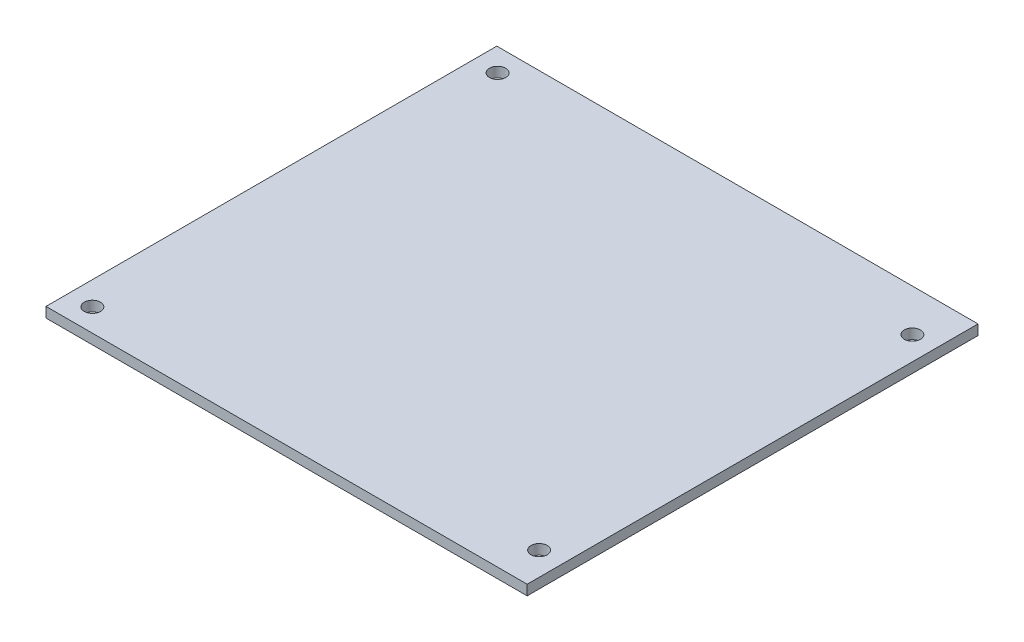
ISO-10303-21;
HEADER;
FILE_DESCRIPTION(('STEP AP214'),'2;1');
FILE_NAME('part.step','',(''),(''),'','','');
FILE_SCHEMA(('AUTOMOTIVE_DESIGN { 1 0 10303 214 1 1 1 1 }'));
ENDSEC;
DATA;
#1=APPLICATION_CONTEXT('core data for automotive mechanical design processes');
#2=APPLICATION_PROTOCOL_DEFINITION('international standard','automotive_design',2000,#1);
#3=PRODUCT_CONTEXT('',#1,'mechanical');
#4=PRODUCT('Part','Part','',(#3));
#5=PRODUCT_RELATED_PRODUCT_CATEGORY('part','',(#4));
#6=PRODUCT_DEFINITION_FORMATION('','',#4);
#7=PRODUCT_DEFINITION_CONTEXT('part definition',#1,'design');
#8=PRODUCT_DEFINITION('design','',#6,#7);
#9=PRODUCT_DEFINITION_SHAPE('','',#8);
#10=(LENGTH_UNIT() NAMED_UNIT(*) SI_UNIT(.MILLI.,.METRE.));
#11=(NAMED_UNIT(*) PLANE_ANGLE_UNIT() SI_UNIT($,.RADIAN.));
#12=(NAMED_UNIT(*) SI_UNIT($,.STERADIAN.) SOLID_ANGLE_UNIT());
#13=UNCERTAINTY_MEASURE_WITH_UNIT(LENGTH_MEASURE(1.E-05),#10,'distance_accuracy_value','');
#14=(GEOMETRIC_REPRESENTATION_CONTEXT(3) GLOBAL_UNCERTAINTY_ASSIGNED_CONTEXT((#13)) GLOBAL_UNIT_ASSIGNED_CONTEXT((#10,
#11,#12)) REPRESENTATION_CONTEXT('',''));
#15=CARTESIAN_POINT('',(0.,0.,0.));
#16=DIRECTION('',(0.,0.,1.));
#17=DIRECTION('',(1.,0.,0.));
#18=AXIS2_PLACEMENT_3D('',#15,#16,#17);
#19=CARTESIAN_POINT('',(0.,2.,0.));
#20=DIRECTION('',(0.,-1.,0.));
#21=DIRECTION('',(0.,0.,-1.));
#22=AXIS2_PLACEMENT_3D('',#19,#20,#21);
#23=PLANE('',#22);
#24=DIRECTION('',(0.,0.,-1.));
#25=VECTOR('',#24,1.);
#26=CARTESIAN_POINT('',(47.5,2.,44.505));
#27=LINE('',#26,#25);
#28=CARTESIAN_POINT('',(47.5,2.,44.505));
#29=VERTEX_POINT('',#28);
#30=CARTESIAN_POINT('',(47.5,2.,-44.505));
#31=VERTEX_POINT('',#30);
#32=EDGE_CURVE('E92',#29,#31,#27,.T.);
#33=ORIENTED_EDGE('',*,*,#32,.T.);
#34=DIRECTION('',(-1.,0.,0.));
#35=VECTOR('',#34,1.);
#36=CARTESIAN_POINT('',(-47.5,2.,-44.505));
#37=LINE('',#36,#35);
#38=CARTESIAN_POINT('',(-47.5,2.,-44.505));
#39=VERTEX_POINT('',#38);
#40=EDGE_CURVE('E87',#31,#39,#37,.T.);
#41=ORIENTED_EDGE('',*,*,#40,.T.);
#42=DIRECTION('',(0.,0.,1.));
#43=VECTOR('',#42,1.);
#44=CARTESIAN_POINT('',(-47.5,2.,44.505));
#45=LINE('',#44,#43);
#46=CARTESIAN_POINT('',(-47.5,2.,44.505));
#47=VERTEX_POINT('',#46);
#48=EDGE_CURVE('E90',#39,#47,#45,.T.);
#49=ORIENTED_EDGE('',*,*,#48,.T.);
#50=DIRECTION('',(1.,0.,0.));
#51=VECTOR('',#50,1.);
#52=CARTESIAN_POINT('',(-47.5,2.,44.505));
#53=LINE('',#52,#51);
#54=EDGE_CURVE('E57',#47,#29,#53,.T.);
#55=ORIENTED_EDGE('',*,*,#54,.T.);
#56=EDGE_LOOP('',(#33,#41,#49,#55));
#57=FACE_BOUND('',#56,.T.);
#58=CARTESIAN_POINT('',(-42.85,2.,-40.));
#59=DIRECTION('',(0.,1.,0.));
#60=DIRECTION('',(0.,0.,1.));
#61=AXIS2_PLACEMENT_3D('',#58,#59,#60);
#62=CIRCLE('',#61,1.6);
#63=CARTESIAN_POINT('',(-42.85,2.,-38.4));
#64=VERTEX_POINT('',#63);
#65=EDGE_CURVE('E107',#64,#64,#62,.T.);
#66=ORIENTED_EDGE('',*,*,#65,.F.);
#67=EDGE_LOOP('',(#66));
#68=FACE_BOUND('',#67,.T.);
#69=CARTESIAN_POINT('',(42.85,2.,-36.2));
#70=DIRECTION('',(0.,1.,0.));
#71=DIRECTION('',(0.,0.,1.));
#72=AXIS2_PLACEMENT_3D('',#69,#70,#71);
#73=CIRCLE('',#72,1.6);
#74=CARTESIAN_POINT('',(42.85,2.,-34.6));
#75=VERTEX_POINT('',#74);
#76=EDGE_CURVE('E122',#75,#75,#73,.T.);
#77=ORIENTED_EDGE('',*,*,#76,.F.);
#78=EDGE_LOOP('',(#77));
#79=FACE_BOUND('',#78,.T.);
#80=CARTESIAN_POINT('',(-42.85,2.,40.));
#81=DIRECTION('',(0.,1.,0.));
#82=DIRECTION('',(0.,0.,1.));
#83=AXIS2_PLACEMENT_3D('',#80,#81,#82);
#84=CIRCLE('',#83,1.6);
#85=CARTESIAN_POINT('',(-42.85,2.,41.6));
#86=VERTEX_POINT('',#85);
#87=EDGE_CURVE('E128',#86,#86,#84,.T.);
#88=ORIENTED_EDGE('',*,*,#87,.F.);
#89=EDGE_LOOP('',(#88));
#90=FACE_BOUND('',#89,.T.);
#91=CARTESIAN_POINT('',(42.85,2.,37.5));
#92=DIRECTION('',(0.,1.,0.));
#93=DIRECTION('',(0.,0.,1.));
#94=AXIS2_PLACEMENT_3D('',#91,#92,#93);
#95=CIRCLE('',#94,1.6);
#96=CARTESIAN_POINT('',(42.85,2.,39.1));
#97=VERTEX_POINT('',#96);
#98=EDGE_CURVE('E134',#97,#97,#95,.T.);
#99=ORIENTED_EDGE('',*,*,#98,.F.);
#100=EDGE_LOOP('',(#99));
#101=FACE_BOUND('',#100,.T.);
#102=ADVANCED_FACE('F40',(#57,#68,#79,#90,#101),#23,.F.);
#103=CARTESIAN_POINT('',(0.,0.,0.));
#104=DIRECTION('',(0.,-1.,0.));
#105=DIRECTION('',(0.,0.,-1.));
#106=AXIS2_PLACEMENT_3D('',#103,#104,#105);
#107=PLANE('',#106);
#108=CARTESIAN_POINT('',(-42.85,0.,40.));
#109=DIRECTION('',(0.,1.,0.));
#110=DIRECTION('',(0.,0.,1.));
#111=AXIS2_PLACEMENT_3D('',#108,#109,#110);
#112=CIRCLE('',#111,1.6);
#113=CARTESIAN_POINT('',(-42.85,0.,41.6));
#114=VERTEX_POINT('',#113);
#115=EDGE_CURVE('E131',#114,#114,#112,.T.);
#116=ORIENTED_EDGE('',*,*,#115,.T.);
#117=EDGE_LOOP('',(#116));
#118=FACE_BOUND('',#117,.T.);
#119=CARTESIAN_POINT('',(-42.85,0.,-40.));
#120=DIRECTION('',(0.,1.,0.));
#121=DIRECTION('',(0.,0.,1.));
#122=AXIS2_PLACEMENT_3D('',#119,#120,#121);
#123=CIRCLE('',#122,1.6);
#124=CARTESIAN_POINT('',(-42.85,0.,-38.4));
#125=VERTEX_POINT('',#124);
#126=EDGE_CURVE('E119',#125,#125,#123,.T.);
#127=ORIENTED_EDGE('',*,*,#126,.T.);
#128=EDGE_LOOP('',(#127));
#129=FACE_BOUND('',#128,.T.);
#130=DIRECTION('',(0.,0.,-1.));
#131=VECTOR('',#130,1.);
#132=CARTESIAN_POINT('',(47.5,0.,44.505));
#133=LINE('',#132,#131);
#134=CARTESIAN_POINT('',(47.5,0.,44.505));
#135=VERTEX_POINT('',#134);
#136=CARTESIAN_POINT('',(47.5,0.,-44.505));
#137=VERTEX_POINT('',#136);
#138=EDGE_CURVE('E104',#135,#137,#133,.T.);
#139=ORIENTED_EDGE('',*,*,#138,.F.);
#140=DIRECTION('',(1.,0.,0.));
#141=VECTOR('',#140,1.);
#142=CARTESIAN_POINT('',(-47.5,0.,44.505));
#143=LINE('',#142,#141);
#144=CARTESIAN_POINT('',(-47.5,0.,44.505));
#145=VERTEX_POINT('',#144);
#146=EDGE_CURVE('E80',#145,#135,#143,.T.);
#147=ORIENTED_EDGE('',*,*,#146,.F.);
#148=DIRECTION('',(0.,0.,1.));
#149=VECTOR('',#148,1.);
#150=CARTESIAN_POINT('',(-47.5,0.,44.505));
#151=LINE('',#150,#149);
#152=CARTESIAN_POINT('',(-47.5,0.,-44.505));
#153=VERTEX_POINT('',#152);
#154=EDGE_CURVE('E74',#153,#145,#151,.T.);
#155=ORIENTED_EDGE('',*,*,#154,.F.);
#156=DIRECTION('',(-1.,0.,0.));
#157=VECTOR('',#156,1.);
#158=CARTESIAN_POINT('',(-47.5,0.,-44.505));
#159=LINE('',#158,#157);
#160=EDGE_CURVE('E96',#137,#153,#159,.T.);
#161=ORIENTED_EDGE('',*,*,#160,.F.);
#162=EDGE_LOOP('',(#139,#147,#155,#161));
#163=FACE_BOUND('',#162,.T.);
#164=CARTESIAN_POINT('',(42.85,0.,-36.2));
#165=DIRECTION('',(0.,1.,0.));
#166=DIRECTION('',(0.,0.,1.));
#167=AXIS2_PLACEMENT_3D('',#164,#165,#166);
#168=CIRCLE('',#167,1.6);
#169=CARTESIAN_POINT('',(42.85,0.,-34.6));
#170=VERTEX_POINT('',#169);
#171=EDGE_CURVE('E125',#170,#170,#168,.T.);
#172=ORIENTED_EDGE('',*,*,#171,.T.);
#173=EDGE_LOOP('',(#172));
#174=FACE_BOUND('',#173,.T.);
#175=CARTESIAN_POINT('',(42.85,0.,37.5));
#176=DIRECTION('',(0.,1.,0.));
#177=DIRECTION('',(0.,0.,1.));
#178=AXIS2_PLACEMENT_3D('',#175,#176,#177);
#179=CIRCLE('',#178,1.6);
#180=CARTESIAN_POINT('',(42.85,0.,39.1));
#181=VERTEX_POINT('',#180);
#182=EDGE_CURVE('E137',#181,#181,#179,.T.);
#183=ORIENTED_EDGE('',*,*,#182,.T.);
#184=EDGE_LOOP('',(#183));
#185=FACE_BOUND('',#184,.T.);
#186=ADVANCED_FACE('F115',(#118,#129,#163,#174,#185),#107,.T.);
#187=CARTESIAN_POINT('',(47.5,2.,44.505));
#188=DIRECTION('',(-1.,0.,0.));
#189=DIRECTION('',(0.,0.,1.));
#190=AXIS2_PLACEMENT_3D('',#187,#188,#189);
#191=PLANE('',#190);
#192=ORIENTED_EDGE('',*,*,#138,.T.);
#193=DIRECTION('',(0.,-1.,0.));
#194=VECTOR('',#193,1.);
#195=CARTESIAN_POINT('',(47.5,2.,-44.505));
#196=LINE('',#195,#194);
#197=EDGE_CURVE('E11',#31,#137,#196,.T.);
#198=ORIENTED_EDGE('',*,*,#197,.F.);
#199=ORIENTED_EDGE('',*,*,#32,.F.);
#200=DIRECTION('',(0.,-1.,0.));
#201=VECTOR('',#200,1.);
#202=CARTESIAN_POINT('',(47.5,2.,44.505));
#203=LINE('',#202,#201);
#204=EDGE_CURVE('E100',#29,#135,#203,.T.);
#205=ORIENTED_EDGE('',*,*,#204,.T.);
#206=EDGE_LOOP('',(#192,#198,#199,#205));
#207=FACE_BOUND('',#206,.T.);
#208=ADVANCED_FACE('F42',(#207),#191,.F.);
#209=CARTESIAN_POINT('',(-47.5,2.,-44.505));
#210=DIRECTION('',(0.,0.,1.));
#211=DIRECTION('',(1.,0.,0.));
#212=AXIS2_PLACEMENT_3D('',#209,#210,#211);
#213=PLANE('',#212);
#214=ORIENTED_EDGE('',*,*,#160,.T.);
#215=DIRECTION('',(0.,-1.,0.));
#216=VECTOR('',#215,1.);
#217=CARTESIAN_POINT('',(-47.5,2.,-44.505));
#218=LINE('',#217,#216);
#219=EDGE_CURVE('E49',#39,#153,#218,.T.);
#220=ORIENTED_EDGE('',*,*,#219,.F.);
#221=ORIENTED_EDGE('',*,*,#40,.F.);
#222=ORIENTED_EDGE('',*,*,#197,.T.);
#223=EDGE_LOOP('',(#214,#220,#221,#222));
#224=FACE_BOUND('',#223,.T.);
#225=ADVANCED_FACE('F95',(#224),#213,.F.);
#226=CARTESIAN_POINT('',(-47.5,2.,44.505));
#227=DIRECTION('',(1.,0.,0.));
#228=DIRECTION('',(0.,0.,-1.));
#229=AXIS2_PLACEMENT_3D('',#226,#227,#228);
#230=PLANE('',#229);
#231=ORIENTED_EDGE('',*,*,#154,.T.);
#232=DIRECTION('',(0.,-1.,0.));
#233=VECTOR('',#232,1.);
#234=CARTESIAN_POINT('',(-47.5,2.,44.505));
#235=LINE('',#234,#233);
#236=EDGE_CURVE('E97',#47,#145,#235,.T.);
#237=ORIENTED_EDGE('',*,*,#236,.F.);
#238=ORIENTED_EDGE('',*,*,#48,.F.);
#239=ORIENTED_EDGE('',*,*,#219,.T.);
#240=EDGE_LOOP('',(#231,#237,#238,#239));
#241=FACE_BOUND('',#240,.T.);
#242=ADVANCED_FACE('F98',(#241),#230,.F.);
#243=CARTESIAN_POINT('',(-47.5,2.,44.505));
#244=DIRECTION('',(0.,0.,-1.));
#245=DIRECTION('',(-1.,0.,0.));
#246=AXIS2_PLACEMENT_3D('',#243,#244,#245);
#247=PLANE('',#246);
#248=ORIENTED_EDGE('',*,*,#146,.T.);
#249=ORIENTED_EDGE('',*,*,#204,.F.);
#250=ORIENTED_EDGE('',*,*,#54,.F.);
#251=ORIENTED_EDGE('',*,*,#236,.T.);
#252=EDGE_LOOP('',(#248,#249,#250,#251));
#253=FACE_BOUND('',#252,.T.);
#254=ADVANCED_FACE('F112',(#253),#247,.F.);
#255=CARTESIAN_POINT('',(-42.85,2.,-40.));
#256=DIRECTION('',(0.,-1.,0.));
#257=DIRECTION('',(0.,0.,-1.));
#258=AXIS2_PLACEMENT_3D('',#255,#256,#257);
#259=CYLINDRICAL_SURFACE('',#258,1.6);
#260=ORIENTED_EDGE('',*,*,#65,.T.);
#261=EDGE_LOOP('',(#260));
#262=FACE_BOUND('',#261,.T.);
#263=ORIENTED_EDGE('',*,*,#126,.F.);
#264=EDGE_LOOP('',(#263));
#265=FACE_BOUND('',#264,.T.);
#266=ADVANCED_FACE('F153',(#262,#265),#259,.F.);
#267=CARTESIAN_POINT('',(42.85,2.,-36.2));
#268=DIRECTION('',(0.,-1.,0.));
#269=DIRECTION('',(0.,0.,-1.));
#270=AXIS2_PLACEMENT_3D('',#267,#268,#269);
#271=CYLINDRICAL_SURFACE('',#270,1.6);
#272=ORIENTED_EDGE('',*,*,#76,.T.);
#273=EDGE_LOOP('',(#272));
#274=FACE_BOUND('',#273,.T.);
#275=ORIENTED_EDGE('',*,*,#171,.F.);
#276=EDGE_LOOP('',(#275));
#277=FACE_BOUND('',#276,.T.);
#278=ADVANCED_FACE('F201',(#274,#277),#271,.F.);
#279=CARTESIAN_POINT('',(-42.85,2.,40.));
#280=DIRECTION('',(0.,-1.,0.));
#281=DIRECTION('',(0.,0.,-1.));
#282=AXIS2_PLACEMENT_3D('',#279,#280,#281);
#283=CYLINDRICAL_SURFACE('',#282,1.6);
#284=ORIENTED_EDGE('',*,*,#87,.T.);
#285=EDGE_LOOP('',(#284));
#286=FACE_BOUND('',#285,.T.);
#287=ORIENTED_EDGE('',*,*,#115,.F.);
#288=EDGE_LOOP('',(#287));
#289=FACE_BOUND('',#288,.T.);
#290=ADVANCED_FACE('F209',(#286,#289),#283,.F.);
#291=CARTESIAN_POINT('',(42.85,2.,37.5));
#292=DIRECTION('',(0.,-1.,0.));
#293=DIRECTION('',(0.,0.,-1.));
#294=AXIS2_PLACEMENT_3D('',#291,#292,#293);
#295=CYLINDRICAL_SURFACE('',#294,1.6);
#296=ORIENTED_EDGE('',*,*,#98,.T.);
#297=EDGE_LOOP('',(#296));
#298=FACE_BOUND('',#297,.T.);
#299=ORIENTED_EDGE('',*,*,#182,.F.);
#300=EDGE_LOOP('',(#299));
#301=FACE_BOUND('',#300,.T.);
#302=ADVANCED_FACE('F143',(#298,#301),#295,.F.);
#303=CLOSED_SHELL('',(#102,#186,#208,#225,#242,#254,#266,#278,#290,#302));
#304=MANIFOLD_SOLID_BREP('B2',#303);
#305=ADVANCED_BREP_SHAPE_REPRESENTATION('',(#18,#304),#14);
#306=SHAPE_DEFINITION_REPRESENTATION(#9,#305);
ENDSEC;
END-ISO-10303-21;
